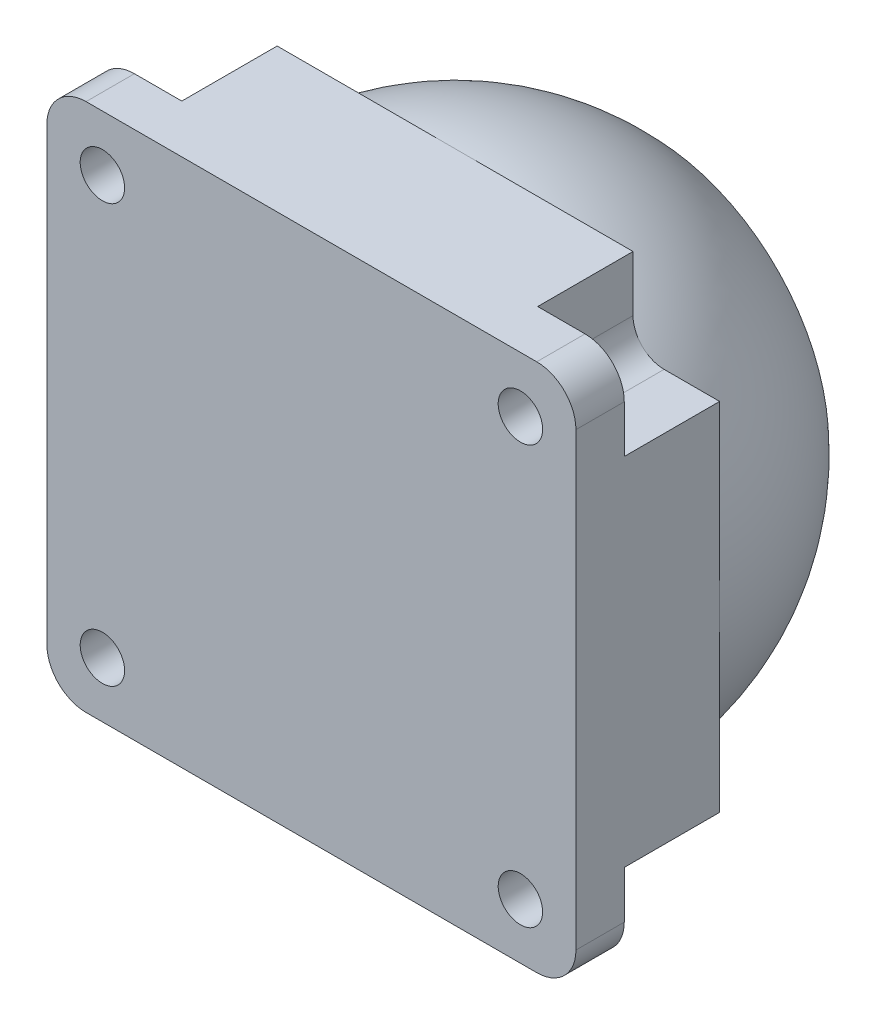
ISO-10303-21;
HEADER;
FILE_DESCRIPTION(('STEP AP214'),'2;1');
FILE_NAME('part.step','',(''),(''),'','','');
FILE_SCHEMA(('AUTOMOTIVE_DESIGN { 1 0 10303 214 1 1 1 1 }'));
ENDSEC;
DATA;
#1=APPLICATION_CONTEXT('core data for automotive mechanical design processes');
#2=APPLICATION_PROTOCOL_DEFINITION('international standard','automotive_design',2000,#1);
#3=PRODUCT_CONTEXT('',#1,'mechanical');
#4=PRODUCT('Part','Part','',(#3));
#5=PRODUCT_RELATED_PRODUCT_CATEGORY('part','',(#4));
#6=PRODUCT_DEFINITION_FORMATION('','',#4);
#7=PRODUCT_DEFINITION_CONTEXT('part definition',#1,'design');
#8=PRODUCT_DEFINITION('design','',#6,#7);
#9=PRODUCT_DEFINITION_SHAPE('','',#8);
#10=(LENGTH_UNIT() NAMED_UNIT(*) SI_UNIT(.MILLI.,.METRE.));
#11=(NAMED_UNIT(*) PLANE_ANGLE_UNIT() SI_UNIT($,.RADIAN.));
#12=(NAMED_UNIT(*) SI_UNIT($,.STERADIAN.) SOLID_ANGLE_UNIT());
#13=UNCERTAINTY_MEASURE_WITH_UNIT(LENGTH_MEASURE(1.E-05),#10,'distance_accuracy_value','');
#14=(GEOMETRIC_REPRESENTATION_CONTEXT(3) GLOBAL_UNCERTAINTY_ASSIGNED_CONTEXT((#13)) GLOBAL_UNIT_ASSIGNED_CONTEXT((#10,
#11,#12)) REPRESENTATION_CONTEXT('',''));
#15=CARTESIAN_POINT('',(0.,0.,0.));
#16=DIRECTION('',(0.,0.,1.));
#17=DIRECTION('',(1.,0.,0.));
#18=AXIS2_PLACEMENT_3D('',#15,#16,#17);
#19=CARTESIAN_POINT('',(0.,0.,0.));
#20=DIRECTION('',(0.,0.,1.));
#21=DIRECTION('',(1.,0.,0.));
#22=AXIS2_PLACEMENT_3D('',#19,#20,#21);
#23=PLANE('',#22);
#24=DIRECTION('',(0.,1.,0.));
#25=VECTOR('',#24,1.);
#26=CARTESIAN_POINT('',(20.25,20.25,0.));
#27=LINE('',#26,#25);
#28=CARTESIAN_POINT('',(20.2500000000001,-13.6225830020296,0.));
#29=VERTEX_POINT('',#28);
#30=CARTESIAN_POINT('',(20.25,0.,0.));
#31=VERTEX_POINT('',#30);
#32=EDGE_CURVE('E382',#29,#31,#27,.T.);
#33=ORIENTED_EDGE('',*,*,#32,.F.);
#34=DIRECTION('',(1.,0.,0.));
#35=VECTOR('',#34,1.);
#36=CARTESIAN_POINT('',(20.2500000000001,-13.6225830020296,0.));
#37=LINE('',#36,#35);
#38=CARTESIAN_POINT('',(16.0000000000011,-13.6225830020296,0.));
#39=VERTEX_POINT('',#38);
#40=EDGE_CURVE('E231',#39,#29,#37,.T.);
#41=ORIENTED_EDGE('',*,*,#40,.F.);
#42=CARTESIAN_POINT('',(16.0000000000011,-15.9999999999998,0.));
#43=DIRECTION('',(0.,0.,-1.));
#44=DIRECTION('',(-1.,0.,0.));
#45=AXIS2_PLACEMENT_3D('',#42,#43,#44);
#46=CIRCLE('',#45,2.37741699797018);
#47=CARTESIAN_POINT('',(14.3189123190282,-14.318912319027,0.));
#48=VERTEX_POINT('',#47);
#49=EDGE_CURVE('E487',#48,#39,#46,.T.);
#50=ORIENTED_EDGE('',*,*,#49,.F.);
#51=CARTESIAN_POINT('',(0.,0.,0.));
#52=DIRECTION('',(0.,0.,1.));
#53=DIRECTION('',(1.,0.,0.));
#54=AXIS2_PLACEMENT_3D('',#51,#52,#53);
#55=CIRCLE('',#54,20.25);
#56=EDGE_CURVE('E381',#48,#31,#55,.T.);
#57=ORIENTED_EDGE('',*,*,#56,.T.);
#58=EDGE_LOOP('',(#33,#41,#50,#57));
#59=FACE_BOUND('',#58,.T.);
#60=ADVANCED_FACE('F36',(#59),#23,.F.);
#61=CARTESIAN_POINT('',(16.0000000000009,-15.9999999999991,11.));
#62=DIRECTION('',(0.,0.,1.));
#63=DIRECTION('',(1.,0.,0.));
#64=AXIS2_PLACEMENT_3D('',#61,#62,#63);
#65=CYLINDRICAL_SURFACE('',#64,1.69999999999999);
#66=CARTESIAN_POINT('',(16.0000000000009,-15.9999999999991,11.));
#67=DIRECTION('',(0.,0.,1.));
#68=DIRECTION('',(1.,0.,0.));
#69=AXIS2_PLACEMENT_3D('',#66,#67,#68);
#70=CIRCLE('',#69,1.69999999999999);
#71=CARTESIAN_POINT('',(17.7000000000009,-15.9999999999991,11.));
#72=VERTEX_POINT('',#71);
#73=EDGE_CURVE('E361',#72,#72,#70,.T.);
#74=ORIENTED_EDGE('',*,*,#73,.T.);
#75=EDGE_LOOP('',(#74));
#76=FACE_BOUND('',#75,.T.);
#77=CARTESIAN_POINT('',(16.0000000000009,-15.9999999999991,7.3));
#78=DIRECTION('',(0.,0.,-1.));
#79=DIRECTION('',(-1.,0.,0.));
#80=AXIS2_PLACEMENT_3D('',#77,#78,#79);
#81=CIRCLE('',#80,1.69999999999999);
#82=CARTESIAN_POINT('',(14.3000000000009,-15.9999999999991,7.3));
#83=VERTEX_POINT('',#82);
#84=EDGE_CURVE('E274',#83,#83,#81,.F.);
#85=ORIENTED_EDGE('',*,*,#84,.F.);
#86=EDGE_LOOP('',(#85));
#87=FACE_BOUND('',#86,.T.);
#88=ADVANCED_FACE('F530',(#76,#87),#65,.F.);
#89=DIRECTION('',(1.,0.,0.));
#90=VECTOR('',#89,1.);
#91=CARTESIAN_POINT('',(-20.25,-20.25,0.));
#92=LINE('',#91,#90);
#93=CARTESIAN_POINT('',(-13.6225830020297,-20.2500000000001,0.));
#94=VERTEX_POINT('',#93);
#95=CARTESIAN_POINT('',(0.,-20.25,0.));
#96=VERTEX_POINT('',#95);
#97=EDGE_CURVE('E372',#94,#96,#92,.T.);
#98=ORIENTED_EDGE('',*,*,#97,.F.);
#99=DIRECTION('',(0.,-1.,0.));
#100=VECTOR('',#99,1.);
#101=CARTESIAN_POINT('',(-13.6225830020297,-20.2500000000001,0.));
#102=LINE('',#101,#100);
#103=CARTESIAN_POINT('',(-13.6225830020297,-16.000000000001,0.));
#104=VERTEX_POINT('',#103);
#105=EDGE_CURVE('E258',#104,#94,#102,.T.);
#106=ORIENTED_EDGE('',*,*,#105,.F.);
#107=CARTESIAN_POINT('',(-15.9999999999999,-16.000000000001,0.));
#108=DIRECTION('',(0.,0.,-1.));
#109=DIRECTION('',(-1.,0.,0.));
#110=AXIS2_PLACEMENT_3D('',#107,#108,#109);
#111=CIRCLE('',#110,2.37741699797018);
#112=CARTESIAN_POINT('',(-14.3189123190271,-14.3189123190281,0.));
#113=VERTEX_POINT('',#112);
#114=EDGE_CURVE('E273',#113,#104,#111,.T.);
#115=ORIENTED_EDGE('',*,*,#114,.F.);
#116=EDGE_CURVE('E396',#113,#96,#55,.T.);
#117=ORIENTED_EDGE('',*,*,#116,.T.);
#118=EDGE_LOOP('',(#98,#106,#115,#117));
#119=FACE_BOUND('',#118,.T.);
#120=ADVANCED_FACE('F532',(#119),#23,.F.);
#121=CARTESIAN_POINT('',(-15.9999999999991,-16.,11.));
#122=DIRECTION('',(0.,0.,1.));
#123=DIRECTION('',(1.,0.,0.));
#124=AXIS2_PLACEMENT_3D('',#121,#122,#123);
#125=CYLINDRICAL_SURFACE('',#124,1.69999999999999);
#126=CARTESIAN_POINT('',(-15.9999999999991,-16.,11.));
#127=DIRECTION('',(0.,0.,1.));
#128=DIRECTION('',(1.,0.,0.));
#129=AXIS2_PLACEMENT_3D('',#126,#127,#128);
#130=CIRCLE('',#129,1.69999999999999);
#131=CARTESIAN_POINT('',(-14.2999999999991,-16.,11.));
#132=VERTEX_POINT('',#131);
#133=EDGE_CURVE('E364',#132,#132,#130,.T.);
#134=ORIENTED_EDGE('',*,*,#133,.T.);
#135=EDGE_LOOP('',(#134));
#136=FACE_BOUND('',#135,.T.);
#137=CARTESIAN_POINT('',(-15.9999999999991,-16.,7.3));
#138=DIRECTION('',(0.,0.,-1.));
#139=DIRECTION('',(-1.,0.,0.));
#140=AXIS2_PLACEMENT_3D('',#137,#138,#139);
#141=CIRCLE('',#140,1.69999999999999);
#142=CARTESIAN_POINT('',(-17.6999999999991,-16.,7.3));
#143=VERTEX_POINT('',#142);
#144=EDGE_CURVE('E281',#143,#143,#141,.F.);
#145=ORIENTED_EDGE('',*,*,#144,.F.);
#146=EDGE_LOOP('',(#145));
#147=FACE_BOUND('',#146,.T.);
#148=ADVANCED_FACE('F542',(#136,#147),#125,.F.);
#149=DIRECTION('',(0.,-1.,0.));
#150=VECTOR('',#149,1.);
#151=CARTESIAN_POINT('',(-20.25,20.25,0.));
#152=LINE('',#151,#150);
#153=CARTESIAN_POINT('',(-20.2500000000001,13.6225830020297,0.));
#154=VERTEX_POINT('',#153);
#155=CARTESIAN_POINT('',(-20.25,0.,0.));
#156=VERTEX_POINT('',#155);
#157=EDGE_CURVE('E389',#154,#156,#152,.T.);
#158=ORIENTED_EDGE('',*,*,#157,.F.);
#159=DIRECTION('',(-1.,0.,0.));
#160=VECTOR('',#159,1.);
#161=CARTESIAN_POINT('',(-20.2500000000001,13.6225830020297,0.));
#162=LINE('',#161,#160);
#163=CARTESIAN_POINT('',(-16.000000000001,13.6225830020298,0.));
#164=VERTEX_POINT('',#163);
#165=EDGE_CURVE('E291',#164,#154,#162,.T.);
#166=ORIENTED_EDGE('',*,*,#165,.F.);
#167=CARTESIAN_POINT('',(-16.000000000001,15.9999999999999,0.));
#168=DIRECTION('',(0.,0.,-1.));
#169=DIRECTION('',(-1.,0.,0.));
#170=AXIS2_PLACEMENT_3D('',#167,#168,#169);
#171=CIRCLE('',#170,2.37741699797018);
#172=CARTESIAN_POINT('',(-14.3189123190281,14.3189123190271,0.));
#173=VERTEX_POINT('',#172);
#174=EDGE_CURVE('E305',#173,#164,#171,.T.);
#175=ORIENTED_EDGE('',*,*,#174,.F.);
#176=EDGE_CURVE('E471',#173,#156,#55,.T.);
#177=ORIENTED_EDGE('',*,*,#176,.T.);
#178=EDGE_LOOP('',(#158,#166,#175,#177));
#179=FACE_BOUND('',#178,.T.);
#180=ADVANCED_FACE('F468',(#179),#23,.F.);
#181=CARTESIAN_POINT('',(-16.,16.,11.));
#182=DIRECTION('',(0.,0.,1.));
#183=DIRECTION('',(1.,0.,0.));
#184=AXIS2_PLACEMENT_3D('',#181,#182,#183);
#185=CYLINDRICAL_SURFACE('',#184,1.69999999999999);
#186=CARTESIAN_POINT('',(-16.,16.,11.));
#187=DIRECTION('',(0.,0.,1.));
#188=DIRECTION('',(1.,0.,0.));
#189=AXIS2_PLACEMENT_3D('',#186,#187,#188);
#190=CIRCLE('',#189,1.69999999999999);
#191=CARTESIAN_POINT('',(-14.3,16.,11.));
#192=VERTEX_POINT('',#191);
#193=EDGE_CURVE('E354',#192,#192,#190,.T.);
#194=ORIENTED_EDGE('',*,*,#193,.T.);
#195=EDGE_LOOP('',(#194));
#196=FACE_BOUND('',#195,.T.);
#197=CARTESIAN_POINT('',(-16.,16.,7.3));
#198=DIRECTION('',(0.,0.,-1.));
#199=DIRECTION('',(-1.,0.,0.));
#200=AXIS2_PLACEMENT_3D('',#197,#198,#199);
#201=CIRCLE('',#200,1.69999999999999);
#202=CARTESIAN_POINT('',(-17.7,16.,7.3));
#203=VERTEX_POINT('',#202);
#204=EDGE_CURVE('E312',#203,#203,#201,.F.);
#205=ORIENTED_EDGE('',*,*,#204,.F.);
#206=EDGE_LOOP('',(#205));
#207=FACE_BOUND('',#206,.T.);
#208=ADVANCED_FACE('F618',(#196,#207),#185,.F.);
#209=DIRECTION('',(-1.,0.,0.));
#210=VECTOR('',#209,1.);
#211=CARTESIAN_POINT('',(-20.25,20.25,0.));
#212=LINE('',#211,#210);
#213=CARTESIAN_POINT('',(13.6225830020298,20.25,0.));
#214=VERTEX_POINT('',#213);
#215=CARTESIAN_POINT('',(0.,20.25,0.));
#216=VERTEX_POINT('',#215);
#217=EDGE_CURVE('E385',#214,#216,#212,.T.);
#218=ORIENTED_EDGE('',*,*,#217,.F.);
#219=DIRECTION('',(0.,1.,0.));
#220=VECTOR('',#219,1.);
#221=CARTESIAN_POINT('',(13.6225830020298,20.25,0.));
#222=LINE('',#221,#220);
#223=CARTESIAN_POINT('',(13.6225830020298,16.0000000000009,0.));
#224=VERTEX_POINT('',#223);
#225=EDGE_CURVE('E322',#224,#214,#222,.T.);
#226=ORIENTED_EDGE('',*,*,#225,.F.);
#227=CARTESIAN_POINT('',(16.,16.0000000000009,0.));
#228=DIRECTION('',(0.,0.,-1.));
#229=DIRECTION('',(-1.,0.,0.));
#230=AXIS2_PLACEMENT_3D('',#227,#228,#229);
#231=CIRCLE('',#230,2.37741699797018);
#232=CARTESIAN_POINT('',(14.3189123190272,14.318912319028,0.));
#233=VERTEX_POINT('',#232);
#234=EDGE_CURVE('E337',#233,#224,#231,.T.);
#235=ORIENTED_EDGE('',*,*,#234,.F.);
#236=CARTESIAN_POINT('',(0.,0.,0.));
#237=DIRECTION('',(0.,0.,1.));
#238=DIRECTION('',(1.,0.,0.));
#239=AXIS2_PLACEMENT_3D('',#236,#237,#238);
#240=CIRCLE('',#239,20.25);
#241=EDGE_CURVE('E355',#233,#216,#240,.T.);
#242=ORIENTED_EDGE('',*,*,#241,.T.);
#243=EDGE_LOOP('',(#218,#226,#235,#242));
#244=FACE_BOUND('',#243,.T.);
#245=ADVANCED_FACE('F598',(#244),#23,.F.);
#246=CARTESIAN_POINT('',(16.,16.0000000000009,11.));
#247=DIRECTION('',(0.,0.,1.));
#248=DIRECTION('',(1.,0.,0.));
#249=AXIS2_PLACEMENT_3D('',#246,#247,#248);
#250=CYLINDRICAL_SURFACE('',#249,1.69999999999999);
#251=CARTESIAN_POINT('',(16.,16.0000000000009,11.));
#252=DIRECTION('',(0.,0.,1.));
#253=DIRECTION('',(1.,0.,0.));
#254=AXIS2_PLACEMENT_3D('',#251,#252,#253);
#255=CIRCLE('',#254,1.69999999999999);
#256=CARTESIAN_POINT('',(17.7,16.0000000000009,11.));
#257=VERTEX_POINT('',#256);
#258=EDGE_CURVE('E358',#257,#257,#255,.T.);
#259=ORIENTED_EDGE('',*,*,#258,.T.);
#260=EDGE_LOOP('',(#259));
#261=FACE_BOUND('',#260,.T.);
#262=CARTESIAN_POINT('',(16.,16.0000000000009,7.3));
#263=DIRECTION('',(0.,0.,-1.));
#264=DIRECTION('',(-1.,0.,0.));
#265=AXIS2_PLACEMENT_3D('',#262,#263,#264);
#266=CIRCLE('',#265,1.69999999999999);
#267=CARTESIAN_POINT('',(14.3,16.0000000000009,7.3));
#268=VERTEX_POINT('',#267);
#269=EDGE_CURVE('E344',#268,#268,#266,.F.);
#270=ORIENTED_EDGE('',*,*,#269,.F.);
#271=EDGE_LOOP('',(#270));
#272=FACE_BOUND('',#271,.T.);
#273=ADVANCED_FACE('F617',(#261,#272),#250,.F.);
#274=CARTESIAN_POINT('',(0.,0.,0.));
#275=DIRECTION('',(0.,0.,1.));
#276=DIRECTION('',(-1.,0.,0.));
#277=AXIS2_PLACEMENT_3D('',#274,#275,#276);
#278=SPHERICAL_SURFACE('',#277,20.25);
#279=EDGE_CURVE('E351',#31,#233,#240,.T.);
#280=ORIENTED_EDGE('',*,*,#279,.F.);
#281=ORIENTED_EDGE('',*,*,#56,.F.);
#282=EDGE_CURVE('E393',#96,#48,#55,.T.);
#283=ORIENTED_EDGE('',*,*,#282,.F.);
#284=ORIENTED_EDGE('',*,*,#116,.F.);
#285=EDGE_CURVE('E397',#156,#113,#55,.T.);
#286=ORIENTED_EDGE('',*,*,#285,.F.);
#287=ORIENTED_EDGE('',*,*,#176,.F.);
#288=EDGE_CURVE('E413',#216,#173,#55,.T.);
#289=ORIENTED_EDGE('',*,*,#288,.F.);
#290=ORIENTED_EDGE('',*,*,#241,.F.);
#291=EDGE_LOOP('',(#280,#281,#283,#284,#286,#287,#289,#290));
#292=FACE_BOUND('',#291,.T.);
#293=CARTESIAN_POINT('',(0.,0.,-15.));
#294=DIRECTION('',(0.,0.,-1.));
#295=DIRECTION('',(-1.,0.,0.));
#296=AXIS2_PLACEMENT_3D('',#293,#294,#295);
#297=CIRCLE('',#296,13.6037678604128);
#298=CARTESIAN_POINT('',(-13.6037678604128,0.,-15.));
#299=VERTEX_POINT('',#298);
#300=EDGE_CURVE('E398',#299,#299,#297,.F.);
#301=ORIENTED_EDGE('',*,*,#300,.T.);
#302=EDGE_LOOP('',(#301));
#303=FACE_BOUND('',#302,.T.);
#304=ADVANCED_FACE('F491',(#292,#303),#278,.T.);
#305=ORIENTED_EDGE('',*,*,#279,.T.);
#306=CARTESIAN_POINT('',(16.,13.6225830020308,0.));
#307=VERTEX_POINT('',#306);
#308=EDGE_CURVE('E338',#307,#233,#231,.T.);
#309=ORIENTED_EDGE('',*,*,#308,.F.);
#310=DIRECTION('',(-1.,0.,0.));
#311=VECTOR('',#310,1.);
#312=CARTESIAN_POINT('',(20.25,13.6225830020308,0.));
#313=LINE('',#312,#311);
#314=CARTESIAN_POINT('',(20.25,13.6225830020308,0.));
#315=VERTEX_POINT('',#314);
#316=EDGE_CURVE('E334',#315,#307,#313,.T.);
#317=ORIENTED_EDGE('',*,*,#316,.F.);
#318=EDGE_CURVE('E367',#31,#315,#27,.T.);
#319=ORIENTED_EDGE('',*,*,#318,.F.);
#320=EDGE_LOOP('',(#305,#309,#317,#319));
#321=FACE_BOUND('',#320,.T.);
#322=ADVANCED_FACE('F497',(#321),#23,.F.);
#323=ORIENTED_EDGE('',*,*,#288,.T.);
#324=CARTESIAN_POINT('',(-13.6225830020308,15.9999999999999,0.));
#325=VERTEX_POINT('',#324);
#326=EDGE_CURVE('E306',#325,#173,#171,.T.);
#327=ORIENTED_EDGE('',*,*,#326,.F.);
#328=DIRECTION('',(0.,-1.,0.));
#329=VECTOR('',#328,1.);
#330=CARTESIAN_POINT('',(-13.6225830020308,20.2499999999999,0.));
#331=LINE('',#330,#329);
#332=CARTESIAN_POINT('',(-13.6225830020308,20.2499999999999,0.));
#333=VERTEX_POINT('',#332);
#334=EDGE_CURVE('E302',#333,#325,#331,.T.);
#335=ORIENTED_EDGE('',*,*,#334,.F.);
#336=EDGE_CURVE('E384',#216,#333,#212,.T.);
#337=ORIENTED_EDGE('',*,*,#336,.F.);
#338=EDGE_LOOP('',(#323,#327,#335,#337));
#339=FACE_BOUND('',#338,.T.);
#340=ADVANCED_FACE('F556',(#339),#23,.F.);
#341=ORIENTED_EDGE('',*,*,#285,.T.);
#342=CARTESIAN_POINT('',(-15.9999999999999,-13.6225830020309,0.));
#343=VERTEX_POINT('',#342);
#344=EDGE_CURVE('E275',#343,#113,#111,.T.);
#345=ORIENTED_EDGE('',*,*,#344,.F.);
#346=DIRECTION('',(1.,0.,0.));
#347=VECTOR('',#346,1.);
#348=CARTESIAN_POINT('',(-20.2499999999999,-13.6225830020309,0.));
#349=LINE('',#348,#347);
#350=CARTESIAN_POINT('',(-20.2499999999999,-13.6225830020309,0.));
#351=VERTEX_POINT('',#350);
#352=EDGE_CURVE('E270',#351,#343,#349,.T.);
#353=ORIENTED_EDGE('',*,*,#352,.F.);
#354=EDGE_CURVE('E388',#156,#351,#152,.T.);
#355=ORIENTED_EDGE('',*,*,#354,.F.);
#356=EDGE_LOOP('',(#341,#345,#353,#355));
#357=FACE_BOUND('',#356,.T.);
#358=ADVANCED_FACE('F546',(#357),#23,.F.);
#359=CARTESIAN_POINT('',(20.25,20.25,11.));
#360=DIRECTION('',(-1.,0.,0.));
#361=DIRECTION('',(0.,-1.,0.));
#362=AXIS2_PLACEMENT_3D('',#359,#360,#361);
#363=PLANE('',#362);
#364=DIRECTION('',(0.,1.,0.));
#365=VECTOR('',#364,1.);
#366=CARTESIAN_POINT('',(20.25,20.25,11.));
#367=LINE('',#366,#365);
#368=CARTESIAN_POINT('',(20.25,-17.25,11.));
#369=VERTEX_POINT('',#368);
#370=CARTESIAN_POINT('',(20.25,17.25,11.));
#371=VERTEX_POINT('',#370);
#372=EDGE_CURVE('E368',#369,#371,#367,.T.);
#373=ORIENTED_EDGE('',*,*,#372,.F.);
#374=DIRECTION('',(0.,0.,-1.));
#375=VECTOR('',#374,1.);
#376=CARTESIAN_POINT('',(20.25,-17.25,11.));
#377=LINE('',#376,#375);
#378=CARTESIAN_POINT('',(20.2500000000002,-17.25,7.3));
#379=VERTEX_POINT('',#378);
#380=EDGE_CURVE('E412',#369,#379,#377,.T.);
#381=ORIENTED_EDGE('',*,*,#380,.T.);
#382=DIRECTION('',(0.,-1.,0.));
#383=VECTOR('',#382,1.);
#384=CARTESIAN_POINT('',(20.2500000000002,-20.2499999999998,7.3));
#385=LINE('',#384,#383);
#386=CARTESIAN_POINT('',(20.2500000000001,-13.6225830020296,7.3));
#387=VERTEX_POINT('',#386);
#388=EDGE_CURVE('E247',#387,#379,#385,.T.);
#389=ORIENTED_EDGE('',*,*,#388,.F.);
#390=DIRECTION('',(0.,0.,-1.));
#391=VECTOR('',#390,1.);
#392=CARTESIAN_POINT('',(20.2500000000001,-13.6225830020296,7.3));
#393=LINE('',#392,#391);
#394=EDGE_CURVE('E409',#387,#29,#393,.T.);
#395=ORIENTED_EDGE('',*,*,#394,.T.);
#396=ORIENTED_EDGE('',*,*,#32,.T.);
#397=ORIENTED_EDGE('',*,*,#318,.T.);
#398=DIRECTION('',(0.,0.,-1.));
#399=VECTOR('',#398,1.);
#400=CARTESIAN_POINT('',(20.25,13.6225830020308,7.3));
#401=LINE('',#400,#399);
#402=CARTESIAN_POINT('',(20.25,13.6225830020308,7.3));
#403=VERTEX_POINT('',#402);
#404=EDGE_CURVE('E333',#403,#315,#401,.T.);
#405=ORIENTED_EDGE('',*,*,#404,.F.);
#406=DIRECTION('',(0.,-1.,0.));
#407=VECTOR('',#406,1.);
#408=CARTESIAN_POINT('',(20.25,20.25,7.3));
#409=LINE('',#408,#407);
#410=CARTESIAN_POINT('',(20.25,17.25,7.3));
#411=VERTEX_POINT('',#410);
#412=EDGE_CURVE('E319',#411,#403,#409,.T.);
#413=ORIENTED_EDGE('',*,*,#412,.F.);
#414=DIRECTION('',(0.,0.,-1.));
#415=VECTOR('',#414,1.);
#416=CARTESIAN_POINT('',(20.25,17.25,11.));
#417=LINE('',#416,#415);
#418=EDGE_CURVE('E410',#411,#371,#417,.F.);
#419=ORIENTED_EDGE('',*,*,#418,.T.);
#420=EDGE_LOOP('',(#373,#381,#389,#395,#396,#397,#405,#413,#419));
#421=FACE_BOUND('',#420,.T.);
#422=ADVANCED_FACE('F501',(#421),#363,.F.);
#423=CARTESIAN_POINT('',(-20.25,20.25,11.));
#424=DIRECTION('',(0.,-1.,0.));
#425=DIRECTION('',(0.,0.,-1.));
#426=AXIS2_PLACEMENT_3D('',#423,#424,#425);
#427=PLANE('',#426);
#428=DIRECTION('',(1.,0.,0.));
#429=VECTOR('',#428,1.);
#430=CARTESIAN_POINT('',(-20.2500000000001,20.2499999999999,7.3));
#431=LINE('',#430,#429);
#432=CARTESIAN_POINT('',(-17.25,20.2499999999999,7.3));
#433=VERTEX_POINT('',#432);
#434=CARTESIAN_POINT('',(-13.6225830020308,20.2499999999999,7.3));
#435=VERTEX_POINT('',#434);
#436=EDGE_CURVE('E288',#433,#435,#431,.T.);
#437=ORIENTED_EDGE('',*,*,#436,.F.);
#438=DIRECTION('',(0.,0.,-1.));
#439=VECTOR('',#438,1.);
#440=CARTESIAN_POINT('',(-17.25,20.25,11.));
#441=LINE('',#440,#439);
#442=CARTESIAN_POINT('',(-17.25,20.25,11.));
#443=VERTEX_POINT('',#442);
#444=EDGE_CURVE('E44',#433,#443,#441,.F.);
#445=ORIENTED_EDGE('',*,*,#444,.T.);
#446=DIRECTION('',(-1.,0.,0.));
#447=VECTOR('',#446,1.);
#448=CARTESIAN_POINT('',(-20.25,20.25,11.));
#449=LINE('',#448,#447);
#450=CARTESIAN_POINT('',(17.25,20.25,11.));
#451=VERTEX_POINT('',#450);
#452=EDGE_CURVE('E371',#451,#443,#449,.T.);
#453=ORIENTED_EDGE('',*,*,#452,.F.);
#454=DIRECTION('',(0.,0.,-1.));
#455=VECTOR('',#454,1.);
#456=CARTESIAN_POINT('',(17.25,20.25,11.));
#457=LINE('',#456,#455);
#458=CARTESIAN_POINT('',(17.25,20.25,7.3));
#459=VERTEX_POINT('',#458);
#460=EDGE_CURVE('E438',#451,#459,#457,.T.);
#461=ORIENTED_EDGE('',*,*,#460,.T.);
#462=DIRECTION('',(1.,0.,0.));
#463=VECTOR('',#462,1.);
#464=CARTESIAN_POINT('',(20.25,20.25,7.3));
#465=LINE('',#464,#463);
#466=CARTESIAN_POINT('',(13.6225830020298,20.25,7.3));
#467=VERTEX_POINT('',#466);
#468=EDGE_CURVE('E330',#467,#459,#465,.T.);
#469=ORIENTED_EDGE('',*,*,#468,.F.);
#470=DIRECTION('',(0.,0.,-1.));
#471=VECTOR('',#470,1.);
#472=CARTESIAN_POINT('',(13.6225830020298,20.25,7.3));
#473=LINE('',#472,#471);
#474=EDGE_CURVE('E341',#467,#214,#473,.T.);
#475=ORIENTED_EDGE('',*,*,#474,.T.);
#476=ORIENTED_EDGE('',*,*,#217,.T.);
#477=ORIENTED_EDGE('',*,*,#336,.T.);
#478=DIRECTION('',(0.,0.,-1.));
#479=VECTOR('',#478,1.);
#480=CARTESIAN_POINT('',(-13.6225830020308,20.2499999999999,7.3));
#481=LINE('',#480,#479);
#482=EDGE_CURVE('E301',#435,#333,#481,.T.);
#483=ORIENTED_EDGE('',*,*,#482,.F.);
#484=EDGE_LOOP('',(#437,#445,#453,#461,#469,#475,#476,#477,#483));
#485=FACE_BOUND('',#484,.T.);
#486=ADVANCED_FACE('F442',(#485),#427,.F.);
#487=CARTESIAN_POINT('',(-20.25,20.25,11.));
#488=DIRECTION('',(1.,0.,0.));
#489=DIRECTION('',(0.,1.,0.));
#490=AXIS2_PLACEMENT_3D('',#487,#488,#489);
#491=PLANE('',#490);
#492=DIRECTION('',(0.,1.,0.));
#493=VECTOR('',#492,1.);
#494=CARTESIAN_POINT('',(-20.2499999999999,-20.2500000000001,7.3));
#495=LINE('',#494,#493);
#496=CARTESIAN_POINT('',(-20.2499999999999,-17.25,7.3));
#497=VERTEX_POINT('',#496);
#498=CARTESIAN_POINT('',(-20.2499999999999,-13.6225830020309,7.3));
#499=VERTEX_POINT('',#498);
#500=EDGE_CURVE('E255',#497,#499,#495,.T.);
#501=ORIENTED_EDGE('',*,*,#500,.F.);
#502=DIRECTION('',(0.,0.,-1.));
#503=VECTOR('',#502,1.);
#504=CARTESIAN_POINT('',(-20.25,-17.25,11.));
#505=LINE('',#504,#503);
#506=CARTESIAN_POINT('',(-20.25,-17.25,11.));
#507=VERTEX_POINT('',#506);
#508=EDGE_CURVE('E435',#497,#507,#505,.F.);
#509=ORIENTED_EDGE('',*,*,#508,.T.);
#510=DIRECTION('',(0.,-1.,0.));
#511=VECTOR('',#510,1.);
#512=CARTESIAN_POINT('',(-20.25,20.25,11.));
#513=LINE('',#512,#511);
#514=CARTESIAN_POINT('',(-20.25,17.25,11.));
#515=VERTEX_POINT('',#514);
#516=EDGE_CURVE('E375',#515,#507,#513,.T.);
#517=ORIENTED_EDGE('',*,*,#516,.F.);
#518=DIRECTION('',(0.,0.,-1.));
#519=VECTOR('',#518,1.);
#520=CARTESIAN_POINT('',(-20.25,17.25,11.));
#521=LINE('',#520,#519);
#522=CARTESIAN_POINT('',(-20.2500000000001,17.25,7.3));
#523=VERTEX_POINT('',#522);
#524=EDGE_CURVE('E432',#515,#523,#521,.T.);
#525=ORIENTED_EDGE('',*,*,#524,.T.);
#526=DIRECTION('',(0.,1.,0.));
#527=VECTOR('',#526,1.);
#528=CARTESIAN_POINT('',(-20.2500000000001,20.2499999999999,7.3));
#529=LINE('',#528,#527);
#530=CARTESIAN_POINT('',(-20.25,13.6225830020297,7.3));
#531=VERTEX_POINT('',#530);
#532=EDGE_CURVE('E299',#531,#523,#529,.T.);
#533=ORIENTED_EDGE('',*,*,#532,.F.);
#534=DIRECTION('',(0.,0.,-1.));
#535=VECTOR('',#534,1.);
#536=CARTESIAN_POINT('',(-20.2500000000001,13.6225830020297,7.3));
#537=LINE('',#536,#535);
#538=EDGE_CURVE('E309',#531,#154,#537,.T.);
#539=ORIENTED_EDGE('',*,*,#538,.T.);
#540=ORIENTED_EDGE('',*,*,#157,.T.);
#541=ORIENTED_EDGE('',*,*,#354,.T.);
#542=DIRECTION('',(0.,0.,-1.));
#543=VECTOR('',#542,1.);
#544=CARTESIAN_POINT('',(-20.2499999999999,-13.6225830020309,7.3));
#545=LINE('',#544,#543);
#546=EDGE_CURVE('E269',#499,#351,#545,.T.);
#547=ORIENTED_EDGE('',*,*,#546,.F.);
#548=EDGE_LOOP('',(#501,#509,#517,#525,#533,#539,#540,#541,#547));
#549=FACE_BOUND('',#548,.T.);
#550=ADVANCED_FACE('F455',(#549),#491,.F.);
#551=CARTESIAN_POINT('',(-20.25,-20.25,11.));
#552=DIRECTION('',(0.,1.,0.));
#553=DIRECTION('',(0.,0.,1.));
#554=AXIS2_PLACEMENT_3D('',#551,#552,#553);
#555=PLANE('',#554);
#556=DIRECTION('',(-1.,0.,0.));
#557=VECTOR('',#556,1.);
#558=CARTESIAN_POINT('',(20.2500000000002,-20.2499999999998,7.3));
#559=LINE('',#558,#557);
#560=CARTESIAN_POINT('',(17.25,-20.2499999999998,7.3));
#561=VERTEX_POINT('',#560);
#562=CARTESIAN_POINT('',(13.622583002031,-20.2499999999998,7.3));
#563=VERTEX_POINT('',#562);
#564=EDGE_CURVE('E220',#561,#563,#559,.T.);
#565=ORIENTED_EDGE('',*,*,#564,.F.);
#566=DIRECTION('',(0.,0.,-1.));
#567=VECTOR('',#566,1.);
#568=CARTESIAN_POINT('',(17.25,-20.25,11.));
#569=LINE('',#568,#567);
#570=CARTESIAN_POINT('',(17.25,-20.25,11.));
#571=VERTEX_POINT('',#570);
#572=EDGE_CURVE('E420',#561,#571,#569,.F.);
#573=ORIENTED_EDGE('',*,*,#572,.T.);
#574=DIRECTION('',(1.,0.,0.));
#575=VECTOR('',#574,1.);
#576=CARTESIAN_POINT('',(-20.25,-20.25,11.));
#577=LINE('',#576,#575);
#578=CARTESIAN_POINT('',(-17.25,-20.25,11.));
#579=VERTEX_POINT('',#578);
#580=EDGE_CURVE('E378',#579,#571,#577,.T.);
#581=ORIENTED_EDGE('',*,*,#580,.F.);
#582=DIRECTION('',(0.,0.,-1.));
#583=VECTOR('',#582,1.);
#584=CARTESIAN_POINT('',(-17.25,-20.25,11.));
#585=LINE('',#584,#583);
#586=CARTESIAN_POINT('',(-17.25,-20.2500000000001,7.3));
#587=VERTEX_POINT('',#586);
#588=EDGE_CURVE('E417',#579,#587,#585,.T.);
#589=ORIENTED_EDGE('',*,*,#588,.T.);
#590=DIRECTION('',(-1.,0.,0.));
#591=VECTOR('',#590,1.);
#592=CARTESIAN_POINT('',(-20.2499999999999,-20.2500000000001,7.3));
#593=LINE('',#592,#591);
#594=CARTESIAN_POINT('',(-13.6225830020297,-20.25,7.3));
#595=VERTEX_POINT('',#594);
#596=EDGE_CURVE('E266',#595,#587,#593,.T.);
#597=ORIENTED_EDGE('',*,*,#596,.F.);
#598=DIRECTION('',(0.,0.,-1.));
#599=VECTOR('',#598,1.);
#600=CARTESIAN_POINT('',(-13.6225830020297,-20.2500000000001,7.3));
#601=LINE('',#600,#599);
#602=EDGE_CURVE('E278',#595,#94,#601,.T.);
#603=ORIENTED_EDGE('',*,*,#602,.T.);
#604=ORIENTED_EDGE('',*,*,#97,.T.);
#605=CARTESIAN_POINT('',(13.6225830020309,-20.25,0.));
#606=VERTEX_POINT('',#605);
#607=EDGE_CURVE('E246',#96,#606,#92,.T.);
#608=ORIENTED_EDGE('',*,*,#607,.T.);
#609=DIRECTION('',(0.,0.,-1.));
#610=VECTOR('',#609,1.);
#611=CARTESIAN_POINT('',(13.622583002031,-20.2499999999998,7.3));
#612=LINE('',#611,#610);
#613=EDGE_CURVE('E236',#563,#606,#612,.T.);
#614=ORIENTED_EDGE('',*,*,#613,.F.);
#615=EDGE_LOOP('',(#565,#573,#581,#589,#597,#603,#604,#608,#614));
#616=FACE_BOUND('',#615,.T.);
#617=ADVANCED_FACE('F243',(#616),#555,.F.);
#618=CARTESIAN_POINT('',(0.,0.,11.));
#619=DIRECTION('',(0.,0.,1.));
#620=DIRECTION('',(1.,0.,0.));
#621=AXIS2_PLACEMENT_3D('',#618,#619,#620);
#622=PLANE('',#621);
#623=ORIENTED_EDGE('',*,*,#193,.F.);
#624=EDGE_LOOP('',(#623));
#625=FACE_BOUND('',#624,.T.);
#626=ORIENTED_EDGE('',*,*,#258,.F.);
#627=EDGE_LOOP('',(#626));
#628=FACE_BOUND('',#627,.T.);
#629=ORIENTED_EDGE('',*,*,#73,.F.);
#630=EDGE_LOOP('',(#629));
#631=FACE_BOUND('',#630,.T.);
#632=ORIENTED_EDGE('',*,*,#133,.F.);
#633=EDGE_LOOP('',(#632));
#634=FACE_BOUND('',#633,.T.);
#635=ORIENTED_EDGE('',*,*,#580,.T.);
#636=CARTESIAN_POINT('',(17.25,-17.25,11.));
#637=DIRECTION('',(0.,0.,1.));
#638=DIRECTION('',(1.,0.,0.));
#639=AXIS2_PLACEMENT_3D('',#636,#637,#638);
#640=CIRCLE('',#639,3.);
#641=EDGE_CURVE('E428',#571,#369,#640,.T.);
#642=ORIENTED_EDGE('',*,*,#641,.T.);
#643=ORIENTED_EDGE('',*,*,#372,.T.);
#644=CARTESIAN_POINT('',(17.25,17.25,11.));
#645=DIRECTION('',(0.,0.,1.));
#646=DIRECTION('',(1.,0.,0.));
#647=AXIS2_PLACEMENT_3D('',#644,#645,#646);
#648=CIRCLE('',#647,3.);
#649=EDGE_CURVE('E422',#371,#451,#648,.T.);
#650=ORIENTED_EDGE('',*,*,#649,.T.);
#651=ORIENTED_EDGE('',*,*,#452,.T.);
#652=CARTESIAN_POINT('',(-17.25,17.25,11.));
#653=DIRECTION('',(0.,0.,1.));
#654=DIRECTION('',(1.,0.,0.));
#655=AXIS2_PLACEMENT_3D('',#652,#653,#654);
#656=CIRCLE('',#655,3.);
#657=EDGE_CURVE('E424',#443,#515,#656,.T.);
#658=ORIENTED_EDGE('',*,*,#657,.T.);
#659=ORIENTED_EDGE('',*,*,#516,.T.);
#660=CARTESIAN_POINT('',(-17.25,-17.25,11.));
#661=DIRECTION('',(0.,0.,1.));
#662=DIRECTION('',(1.,0.,0.));
#663=AXIS2_PLACEMENT_3D('',#660,#661,#662);
#664=CIRCLE('',#663,3.);
#665=EDGE_CURVE('E426',#507,#579,#664,.T.);
#666=ORIENTED_EDGE('',*,*,#665,.T.);
#667=EDGE_LOOP('',(#635,#642,#643,#650,#651,#658,#659,#666));
#668=FACE_BOUND('',#667,.T.);
#669=ADVANCED_FACE('F447',(#625,#628,#631,#634,#668),#622,.T.);
#670=ORIENTED_EDGE('',*,*,#282,.T.);
#671=CARTESIAN_POINT('',(13.6225830020309,-15.9999999999999,0.));
#672=VERTEX_POINT('',#671);
#673=EDGE_CURVE('E512',#672,#48,#46,.T.);
#674=ORIENTED_EDGE('',*,*,#673,.F.);
#675=DIRECTION('',(0.,1.,0.));
#676=VECTOR('',#675,1.);
#677=CARTESIAN_POINT('',(13.622583002031,-20.2499999999998,0.));
#678=LINE('',#677,#676);
#679=EDGE_CURVE('E514',#606,#672,#678,.T.);
#680=ORIENTED_EDGE('',*,*,#679,.F.);
#681=ORIENTED_EDGE('',*,*,#607,.F.);
#682=EDGE_LOOP('',(#670,#674,#680,#681));
#683=FACE_BOUND('',#682,.T.);
#684=ADVANCED_FACE('F533',(#683),#23,.F.);
#685=CARTESIAN_POINT('',(0.,0.,-15.));
#686=DIRECTION('',(0.,0.,-1.));
#687=DIRECTION('',(-1.,0.,0.));
#688=AXIS2_PLACEMENT_3D('',#685,#686,#687);
#689=PLANE('',#688);
#690=ORIENTED_EDGE('',*,*,#300,.F.);
#691=EDGE_LOOP('',(#690));
#692=FACE_BOUND('',#691,.T.);
#693=ADVANCED_FACE('F544',(#692),#689,.T.);
#694=CARTESIAN_POINT('',(16.,16.0000000000009,7.3));
#695=DIRECTION('',(0.,0.,-1.));
#696=DIRECTION('',(-1.,0.,0.));
#697=AXIS2_PLACEMENT_3D('',#694,#695,#696);
#698=PLANE('',#697);
#699=ORIENTED_EDGE('',*,*,#468,.T.);
#700=CARTESIAN_POINT('',(17.25,17.25,7.3));
#701=DIRECTION('',(0.,0.,-1.));
#702=DIRECTION('',(-1.,0.,0.));
#703=AXIS2_PLACEMENT_3D('',#700,#701,#702);
#704=CIRCLE('',#703,3.);
#705=EDGE_CURVE('E11',#459,#411,#704,.T.);
#706=ORIENTED_EDGE('',*,*,#705,.T.);
#707=ORIENTED_EDGE('',*,*,#412,.T.);
#708=DIRECTION('',(-1.,0.,0.));
#709=VECTOR('',#708,1.);
#710=CARTESIAN_POINT('',(20.25,13.6225830020308,7.3));
#711=LINE('',#710,#709);
#712=CARTESIAN_POINT('',(16.,13.6225830020308,7.3));
#713=VERTEX_POINT('',#712);
#714=EDGE_CURVE('E321',#403,#713,#711,.T.);
#715=ORIENTED_EDGE('',*,*,#714,.T.);
#716=CARTESIAN_POINT('',(16.,16.0000000000009,7.3));
#717=DIRECTION('',(0.,0.,-1.));
#718=DIRECTION('',(-1.,0.,0.));
#719=AXIS2_PLACEMENT_3D('',#716,#717,#718);
#720=CIRCLE('',#719,2.37741699797018);
#721=CARTESIAN_POINT('',(13.6225830020298,16.0000000000009,7.3));
#722=VERTEX_POINT('',#721);
#723=EDGE_CURVE('E325',#713,#722,#720,.T.);
#724=ORIENTED_EDGE('',*,*,#723,.T.);
#725=DIRECTION('',(0.,1.,0.));
#726=VECTOR('',#725,1.);
#727=CARTESIAN_POINT('',(13.6225830020298,20.25,7.3));
#728=LINE('',#727,#726);
#729=EDGE_CURVE('E328',#722,#467,#728,.T.);
#730=ORIENTED_EDGE('',*,*,#729,.T.);
#731=EDGE_LOOP('',(#699,#706,#707,#715,#724,#730));
#732=FACE_BOUND('',#731,.T.);
#733=ORIENTED_EDGE('',*,*,#269,.T.);
#734=EDGE_LOOP('',(#733));
#735=FACE_BOUND('',#734,.T.);
#736=ADVANCED_FACE('F551',(#732,#735),#698,.T.);
#737=CARTESIAN_POINT('',(13.6225830020298,20.25,7.3));
#738=DIRECTION('',(-1.,0.,0.));
#739=DIRECTION('',(0.,-1.,0.));
#740=AXIS2_PLACEMENT_3D('',#737,#738,#739);
#741=PLANE('',#740);
#742=ORIENTED_EDGE('',*,*,#225,.T.);
#743=ORIENTED_EDGE('',*,*,#474,.F.);
#744=ORIENTED_EDGE('',*,*,#729,.F.);
#745=DIRECTION('',(0.,0.,-1.));
#746=VECTOR('',#745,1.);
#747=CARTESIAN_POINT('',(13.6225830020298,16.0000000000009,7.3));
#748=LINE('',#747,#746);
#749=EDGE_CURVE('E345',#722,#224,#748,.T.);
#750=ORIENTED_EDGE('',*,*,#749,.T.);
#751=EDGE_LOOP('',(#742,#743,#744,#750));
#752=FACE_BOUND('',#751,.T.);
#753=ADVANCED_FACE('F593',(#752),#741,.F.);
#754=CARTESIAN_POINT('',(16.,16.0000000000009,7.3));
#755=DIRECTION('',(0.,0.,-1.));
#756=DIRECTION('',(-1.,0.,0.));
#757=AXIS2_PLACEMENT_3D('',#754,#755,#756);
#758=CYLINDRICAL_SURFACE('',#757,2.37741699797018);
#759=ORIENTED_EDGE('',*,*,#308,.T.);
#760=ORIENTED_EDGE('',*,*,#234,.T.);
#761=ORIENTED_EDGE('',*,*,#749,.F.);
#762=ORIENTED_EDGE('',*,*,#723,.F.);
#763=DIRECTION('',(0.,0.,-1.));
#764=VECTOR('',#763,1.);
#765=CARTESIAN_POINT('',(16.,13.6225830020308,7.3));
#766=LINE('',#765,#764);
#767=EDGE_CURVE('E348',#713,#307,#766,.T.);
#768=ORIENTED_EDGE('',*,*,#767,.T.);
#769=EDGE_LOOP('',(#759,#760,#761,#762,#768));
#770=FACE_BOUND('',#769,.T.);
#771=ADVANCED_FACE('F601',(#770),#758,.F.);
#772=CARTESIAN_POINT('',(20.25,13.6225830020308,7.3));
#773=DIRECTION('',(0.,-1.,0.));
#774=DIRECTION('',(1.,0.,0.));
#775=AXIS2_PLACEMENT_3D('',#772,#773,#774);
#776=PLANE('',#775);
#777=ORIENTED_EDGE('',*,*,#316,.T.);
#778=ORIENTED_EDGE('',*,*,#767,.F.);
#779=ORIENTED_EDGE('',*,*,#714,.F.);
#780=ORIENTED_EDGE('',*,*,#404,.T.);
#781=EDGE_LOOP('',(#777,#778,#779,#780));
#782=FACE_BOUND('',#781,.T.);
#783=ADVANCED_FACE('F604',(#782),#776,.F.);
#784=CARTESIAN_POINT('',(-16.000000000001,15.9999999999999,7.3));
#785=DIRECTION('',(0.,0.,-1.));
#786=DIRECTION('',(-1.,0.,0.));
#787=AXIS2_PLACEMENT_3D('',#784,#785,#786);
#788=PLANE('',#787);
#789=ORIENTED_EDGE('',*,*,#532,.T.);
#790=CARTESIAN_POINT('',(-17.25,17.25,7.3));
#791=DIRECTION('',(0.,0.,-1.));
#792=DIRECTION('',(-1.,0.,0.));
#793=AXIS2_PLACEMENT_3D('',#790,#791,#792);
#794=CIRCLE('',#793,3.);
#795=EDGE_CURVE('E57',#523,#433,#794,.T.);
#796=ORIENTED_EDGE('',*,*,#795,.T.);
#797=ORIENTED_EDGE('',*,*,#436,.T.);
#798=DIRECTION('',(0.,-1.,0.));
#799=VECTOR('',#798,1.);
#800=CARTESIAN_POINT('',(-13.6225830020308,20.2499999999999,7.3));
#801=LINE('',#800,#799);
#802=CARTESIAN_POINT('',(-13.6225830020308,15.9999999999999,7.3));
#803=VERTEX_POINT('',#802);
#804=EDGE_CURVE('E290',#435,#803,#801,.T.);
#805=ORIENTED_EDGE('',*,*,#804,.T.);
#806=CARTESIAN_POINT('',(-16.000000000001,15.9999999999999,7.3));
#807=DIRECTION('',(0.,0.,-1.));
#808=DIRECTION('',(-1.,0.,0.));
#809=AXIS2_PLACEMENT_3D('',#806,#807,#808);
#810=CIRCLE('',#809,2.37741699797018);
#811=CARTESIAN_POINT('',(-16.000000000001,13.6225830020298,7.3));
#812=VERTEX_POINT('',#811);
#813=EDGE_CURVE('E294',#803,#812,#810,.T.);
#814=ORIENTED_EDGE('',*,*,#813,.T.);
#815=DIRECTION('',(-1.,0.,0.));
#816=VECTOR('',#815,1.);
#817=CARTESIAN_POINT('',(-20.2500000000001,13.6225830020297,7.3));
#818=LINE('',#817,#816);
#819=EDGE_CURVE('E297',#812,#531,#818,.T.);
#820=ORIENTED_EDGE('',*,*,#819,.T.);
#821=EDGE_LOOP('',(#789,#796,#797,#805,#814,#820));
#822=FACE_BOUND('',#821,.T.);
#823=ORIENTED_EDGE('',*,*,#204,.T.);
#824=EDGE_LOOP('',(#823));
#825=FACE_BOUND('',#824,.T.);
#826=ADVANCED_FACE('F456',(#822,#825),#788,.T.);
#827=CARTESIAN_POINT('',(-20.2500000000001,13.6225830020297,7.3));
#828=DIRECTION('',(0.,-1.,0.));
#829=DIRECTION('',(1.,0.,0.));
#830=AXIS2_PLACEMENT_3D('',#827,#828,#829);
#831=PLANE('',#830);
#832=ORIENTED_EDGE('',*,*,#165,.T.);
#833=ORIENTED_EDGE('',*,*,#538,.F.);
#834=ORIENTED_EDGE('',*,*,#819,.F.);
#835=DIRECTION('',(0.,0.,-1.));
#836=VECTOR('',#835,1.);
#837=CARTESIAN_POINT('',(-16.000000000001,13.6225830020298,7.3));
#838=LINE('',#837,#836);
#839=EDGE_CURVE('E313',#812,#164,#838,.T.);
#840=ORIENTED_EDGE('',*,*,#839,.T.);
#841=EDGE_LOOP('',(#832,#833,#834,#840));
#842=FACE_BOUND('',#841,.T.);
#843=ADVANCED_FACE('F462',(#842),#831,.F.);
#844=CARTESIAN_POINT('',(-16.000000000001,15.9999999999999,7.3));
#845=DIRECTION('',(0.,0.,-1.));
#846=DIRECTION('',(-1.,0.,0.));
#847=AXIS2_PLACEMENT_3D('',#844,#845,#846);
#848=CYLINDRICAL_SURFACE('',#847,2.37741699797018);
#849=ORIENTED_EDGE('',*,*,#326,.T.);
#850=ORIENTED_EDGE('',*,*,#174,.T.);
#851=ORIENTED_EDGE('',*,*,#839,.F.);
#852=ORIENTED_EDGE('',*,*,#813,.F.);
#853=DIRECTION('',(0.,0.,-1.));
#854=VECTOR('',#853,1.);
#855=CARTESIAN_POINT('',(-13.6225830020308,15.9999999999999,7.3));
#856=LINE('',#855,#854);
#857=EDGE_CURVE('E316',#803,#325,#856,.T.);
#858=ORIENTED_EDGE('',*,*,#857,.T.);
#859=EDGE_LOOP('',(#849,#850,#851,#852,#858));
#860=FACE_BOUND('',#859,.T.);
#861=ADVANCED_FACE('F644',(#860),#848,.F.);
#862=CARTESIAN_POINT('',(-13.6225830020308,20.2499999999999,7.3));
#863=DIRECTION('',(1.,0.,0.));
#864=DIRECTION('',(0.,1.,0.));
#865=AXIS2_PLACEMENT_3D('',#862,#863,#864);
#866=PLANE('',#865);
#867=ORIENTED_EDGE('',*,*,#334,.T.);
#868=ORIENTED_EDGE('',*,*,#857,.F.);
#869=ORIENTED_EDGE('',*,*,#804,.F.);
#870=ORIENTED_EDGE('',*,*,#482,.T.);
#871=EDGE_LOOP('',(#867,#868,#869,#870));
#872=FACE_BOUND('',#871,.T.);
#873=ADVANCED_FACE('F635',(#872),#866,.F.);
#874=CARTESIAN_POINT('',(-15.9999999999999,-16.000000000001,7.3));
#875=DIRECTION('',(0.,0.,-1.));
#876=DIRECTION('',(-1.,0.,0.));
#877=AXIS2_PLACEMENT_3D('',#874,#875,#876);
#878=PLANE('',#877);
#879=ORIENTED_EDGE('',*,*,#596,.T.);
#880=CARTESIAN_POINT('',(-17.25,-17.25,7.3));
#881=DIRECTION('',(0.,0.,-1.));
#882=DIRECTION('',(-1.,0.,0.));
#883=AXIS2_PLACEMENT_3D('',#880,#881,#882);
#884=CIRCLE('',#883,3.);
#885=EDGE_CURVE('E430',#587,#497,#884,.T.);
#886=ORIENTED_EDGE('',*,*,#885,.T.);
#887=ORIENTED_EDGE('',*,*,#500,.T.);
#888=DIRECTION('',(1.,0.,0.));
#889=VECTOR('',#888,1.);
#890=CARTESIAN_POINT('',(-20.2499999999999,-13.6225830020309,7.3));
#891=LINE('',#890,#889);
#892=CARTESIAN_POINT('',(-15.9999999999999,-13.6225830020309,7.3));
#893=VERTEX_POINT('',#892);
#894=EDGE_CURVE('E257',#499,#893,#891,.T.);
#895=ORIENTED_EDGE('',*,*,#894,.T.);
#896=CARTESIAN_POINT('',(-15.9999999999999,-16.000000000001,7.3));
#897=DIRECTION('',(0.,0.,-1.));
#898=DIRECTION('',(-1.,0.,0.));
#899=AXIS2_PLACEMENT_3D('',#896,#897,#898);
#900=CIRCLE('',#899,2.37741699797018);
#901=CARTESIAN_POINT('',(-13.6225830020297,-16.000000000001,7.3));
#902=VERTEX_POINT('',#901);
#903=EDGE_CURVE('E261',#893,#902,#900,.T.);
#904=ORIENTED_EDGE('',*,*,#903,.T.);
#905=DIRECTION('',(0.,-1.,0.));
#906=VECTOR('',#905,1.);
#907=CARTESIAN_POINT('',(-13.6225830020297,-20.2500000000001,7.3));
#908=LINE('',#907,#906);
#909=EDGE_CURVE('E264',#902,#595,#908,.T.);
#910=ORIENTED_EDGE('',*,*,#909,.T.);
#911=EDGE_LOOP('',(#879,#886,#887,#895,#904,#910));
#912=FACE_BOUND('',#911,.T.);
#913=ORIENTED_EDGE('',*,*,#144,.T.);
#914=EDGE_LOOP('',(#913));
#915=FACE_BOUND('',#914,.T.);
#916=ADVANCED_FACE('F574',(#912,#915),#878,.T.);
#917=CARTESIAN_POINT('',(-13.6225830020297,-20.2500000000001,7.3));
#918=DIRECTION('',(1.,0.,0.));
#919=DIRECTION('',(0.,1.,0.));
#920=AXIS2_PLACEMENT_3D('',#917,#918,#919);
#921=PLANE('',#920);
#922=ORIENTED_EDGE('',*,*,#105,.T.);
#923=ORIENTED_EDGE('',*,*,#602,.F.);
#924=ORIENTED_EDGE('',*,*,#909,.F.);
#925=DIRECTION('',(0.,0.,-1.));
#926=VECTOR('',#925,1.);
#927=CARTESIAN_POINT('',(-13.6225830020297,-16.000000000001,7.3));
#928=LINE('',#927,#926);
#929=EDGE_CURVE('E282',#902,#104,#928,.T.);
#930=ORIENTED_EDGE('',*,*,#929,.T.);
#931=EDGE_LOOP('',(#922,#923,#924,#930));
#932=FACE_BOUND('',#931,.T.);
#933=ADVANCED_FACE('F634',(#932),#921,.F.);
#934=CARTESIAN_POINT('',(-15.9999999999999,-16.000000000001,7.3));
#935=DIRECTION('',(0.,0.,-1.));
#936=DIRECTION('',(-1.,0.,0.));
#937=AXIS2_PLACEMENT_3D('',#934,#935,#936);
#938=CYLINDRICAL_SURFACE('',#937,2.37741699797018);
#939=ORIENTED_EDGE('',*,*,#344,.T.);
#940=ORIENTED_EDGE('',*,*,#114,.T.);
#941=ORIENTED_EDGE('',*,*,#929,.F.);
#942=ORIENTED_EDGE('',*,*,#903,.F.);
#943=DIRECTION('',(0.,0.,-1.));
#944=VECTOR('',#943,1.);
#945=CARTESIAN_POINT('',(-15.9999999999999,-13.6225830020309,7.3));
#946=LINE('',#945,#944);
#947=EDGE_CURVE('E285',#893,#343,#946,.T.);
#948=ORIENTED_EDGE('',*,*,#947,.T.);
#949=EDGE_LOOP('',(#939,#940,#941,#942,#948));
#950=FACE_BOUND('',#949,.T.);
#951=ADVANCED_FACE('F641',(#950),#938,.F.);
#952=CARTESIAN_POINT('',(-20.2499999999999,-13.6225830020309,7.3));
#953=DIRECTION('',(0.,1.,0.));
#954=DIRECTION('',(-1.,0.,0.));
#955=AXIS2_PLACEMENT_3D('',#952,#953,#954);
#956=PLANE('',#955);
#957=ORIENTED_EDGE('',*,*,#352,.T.);
#958=ORIENTED_EDGE('',*,*,#947,.F.);
#959=ORIENTED_EDGE('',*,*,#894,.F.);
#960=ORIENTED_EDGE('',*,*,#546,.T.);
#961=EDGE_LOOP('',(#957,#958,#959,#960));
#962=FACE_BOUND('',#961,.T.);
#963=ADVANCED_FACE('F527',(#962),#956,.F.);
#964=CARTESIAN_POINT('',(16.0000000000011,-15.9999999999998,7.3));
#965=DIRECTION('',(0.,0.,-1.));
#966=DIRECTION('',(-1.,0.,0.));
#967=AXIS2_PLACEMENT_3D('',#964,#965,#966);
#968=PLANE('',#967);
#969=ORIENTED_EDGE('',*,*,#388,.T.);
#970=CARTESIAN_POINT('',(17.25,-17.25,7.3));
#971=DIRECTION('',(0.,0.,-1.));
#972=DIRECTION('',(-1.,0.,0.));
#973=AXIS2_PLACEMENT_3D('',#970,#971,#972);
#974=CIRCLE('',#973,3.);
#975=EDGE_CURVE('E227',#379,#561,#974,.T.);
#976=ORIENTED_EDGE('',*,*,#975,.T.);
#977=ORIENTED_EDGE('',*,*,#564,.T.);
#978=DIRECTION('',(0.,1.,0.));
#979=VECTOR('',#978,1.);
#980=CARTESIAN_POINT('',(13.622583002031,-20.2499999999998,7.3));
#981=LINE('',#980,#979);
#982=CARTESIAN_POINT('',(13.6225830020309,-15.9999999999999,7.3));
#983=VERTEX_POINT('',#982);
#984=EDGE_CURVE('E226',#563,#983,#981,.T.);
#985=ORIENTED_EDGE('',*,*,#984,.T.);
#986=CARTESIAN_POINT('',(16.0000000000011,-15.9999999999998,7.3));
#987=DIRECTION('',(0.,0.,-1.));
#988=DIRECTION('',(-1.,0.,0.));
#989=AXIS2_PLACEMENT_3D('',#986,#987,#988);
#990=CIRCLE('',#989,2.37741699797018);
#991=CARTESIAN_POINT('',(16.0000000000011,-13.6225830020296,7.3));
#992=VERTEX_POINT('',#991);
#993=EDGE_CURVE('E240',#983,#992,#990,.T.);
#994=ORIENTED_EDGE('',*,*,#993,.T.);
#995=DIRECTION('',(1.,0.,0.));
#996=VECTOR('',#995,1.);
#997=CARTESIAN_POINT('',(20.2500000000001,-13.6225830020296,7.3));
#998=LINE('',#997,#996);
#999=EDGE_CURVE('E251',#992,#387,#998,.T.);
#1000=ORIENTED_EDGE('',*,*,#999,.T.);
#1001=EDGE_LOOP('',(#969,#976,#977,#985,#994,#1000));
#1002=FACE_BOUND('',#1001,.T.);
#1003=ORIENTED_EDGE('',*,*,#84,.T.);
#1004=EDGE_LOOP('',(#1003));
#1005=FACE_BOUND('',#1004,.T.);
#1006=ADVANCED_FACE('F223',(#1002,#1005),#968,.T.);
#1007=CARTESIAN_POINT('',(20.2500000000001,-13.6225830020296,7.3));
#1008=DIRECTION('',(0.,1.,0.));
#1009=DIRECTION('',(-1.,0.,0.));
#1010=AXIS2_PLACEMENT_3D('',#1007,#1008,#1009);
#1011=PLANE('',#1010);
#1012=ORIENTED_EDGE('',*,*,#40,.T.);
#1013=ORIENTED_EDGE('',*,*,#394,.F.);
#1014=ORIENTED_EDGE('',*,*,#999,.F.);
#1015=DIRECTION('',(0.,0.,-1.));
#1016=VECTOR('',#1015,1.);
#1017=CARTESIAN_POINT('',(16.0000000000011,-13.6225830020296,7.3));
#1018=LINE('',#1017,#1016);
#1019=EDGE_CURVE('E249',#992,#39,#1018,.T.);
#1020=ORIENTED_EDGE('',*,*,#1019,.T.);
#1021=EDGE_LOOP('',(#1012,#1013,#1014,#1020));
#1022=FACE_BOUND('',#1021,.T.);
#1023=ADVANCED_FACE('F519',(#1022),#1011,.F.);
#1024=CARTESIAN_POINT('',(16.0000000000011,-15.9999999999998,7.3));
#1025=DIRECTION('',(0.,0.,-1.));
#1026=DIRECTION('',(-1.,0.,0.));
#1027=AXIS2_PLACEMENT_3D('',#1024,#1025,#1026);
#1028=CYLINDRICAL_SURFACE('',#1027,2.37741699797018);
#1029=ORIENTED_EDGE('',*,*,#673,.T.);
#1030=ORIENTED_EDGE('',*,*,#49,.T.);
#1031=ORIENTED_EDGE('',*,*,#1019,.F.);
#1032=ORIENTED_EDGE('',*,*,#993,.F.);
#1033=DIRECTION('',(0.,0.,-1.));
#1034=VECTOR('',#1033,1.);
#1035=CARTESIAN_POINT('',(13.6225830020309,-15.9999999999999,7.3));
#1036=LINE('',#1035,#1034);
#1037=EDGE_CURVE('E238',#983,#672,#1036,.T.);
#1038=ORIENTED_EDGE('',*,*,#1037,.T.);
#1039=EDGE_LOOP('',(#1029,#1030,#1031,#1032,#1038));
#1040=FACE_BOUND('',#1039,.T.);
#1041=ADVANCED_FACE('F518',(#1040),#1028,.F.);
#1042=CARTESIAN_POINT('',(13.622583002031,-20.2499999999998,7.3));
#1043=DIRECTION('',(-1.,0.,0.));
#1044=DIRECTION('',(0.,-1.,0.));
#1045=AXIS2_PLACEMENT_3D('',#1042,#1043,#1044);
#1046=PLANE('',#1045);
#1047=ORIENTED_EDGE('',*,*,#679,.T.);
#1048=ORIENTED_EDGE('',*,*,#1037,.F.);
#1049=ORIENTED_EDGE('',*,*,#984,.F.);
#1050=ORIENTED_EDGE('',*,*,#613,.T.);
#1051=EDGE_LOOP('',(#1047,#1048,#1049,#1050));
#1052=FACE_BOUND('',#1051,.T.);
#1053=ADVANCED_FACE('F235',(#1052),#1046,.F.);
#1054=CARTESIAN_POINT('',(17.25,-17.25,11.));
#1055=DIRECTION('',(0.,0.,-1.));
#1056=DIRECTION('',(-1.,0.,0.));
#1057=AXIS2_PLACEMENT_3D('',#1054,#1055,#1056);
#1058=CYLINDRICAL_SURFACE('',#1057,3.);
#1059=ORIENTED_EDGE('',*,*,#641,.F.);
#1060=ORIENTED_EDGE('',*,*,#572,.F.);
#1061=ORIENTED_EDGE('',*,*,#975,.F.);
#1062=ORIENTED_EDGE('',*,*,#380,.F.);
#1063=EDGE_LOOP('',(#1059,#1060,#1061,#1062));
#1064=FACE_BOUND('',#1063,.T.);
#1065=ADVANCED_FACE('F585',(#1064),#1058,.T.);
#1066=CARTESIAN_POINT('',(-17.25,-17.25,11.));
#1067=DIRECTION('',(0.,0.,-1.));
#1068=DIRECTION('',(-1.,0.,0.));
#1069=AXIS2_PLACEMENT_3D('',#1066,#1067,#1068);
#1070=CYLINDRICAL_SURFACE('',#1069,3.);
#1071=ORIENTED_EDGE('',*,*,#665,.F.);
#1072=ORIENTED_EDGE('',*,*,#508,.F.);
#1073=ORIENTED_EDGE('',*,*,#885,.F.);
#1074=ORIENTED_EDGE('',*,*,#588,.F.);
#1075=EDGE_LOOP('',(#1071,#1072,#1073,#1074));
#1076=FACE_BOUND('',#1075,.T.);
#1077=ADVANCED_FACE('F580',(#1076),#1070,.T.);
#1078=CARTESIAN_POINT('',(-17.25,17.25,11.));
#1079=DIRECTION('',(0.,0.,-1.));
#1080=DIRECTION('',(-1.,0.,0.));
#1081=AXIS2_PLACEMENT_3D('',#1078,#1079,#1080);
#1082=CYLINDRICAL_SURFACE('',#1081,3.);
#1083=ORIENTED_EDGE('',*,*,#657,.F.);
#1084=ORIENTED_EDGE('',*,*,#444,.F.);
#1085=ORIENTED_EDGE('',*,*,#795,.F.);
#1086=ORIENTED_EDGE('',*,*,#524,.F.);
#1087=EDGE_LOOP('',(#1083,#1084,#1085,#1086));
#1088=FACE_BOUND('',#1087,.T.);
#1089=ADVANCED_FACE('F451',(#1088),#1082,.T.);
#1090=CARTESIAN_POINT('',(17.25,17.25,11.));
#1091=DIRECTION('',(0.,0.,-1.));
#1092=DIRECTION('',(-1.,0.,0.));
#1093=AXIS2_PLACEMENT_3D('',#1090,#1091,#1092);
#1094=CYLINDRICAL_SURFACE('',#1093,3.);
#1095=ORIENTED_EDGE('',*,*,#649,.F.);
#1096=ORIENTED_EDGE('',*,*,#418,.F.);
#1097=ORIENTED_EDGE('',*,*,#705,.F.);
#1098=ORIENTED_EDGE('',*,*,#460,.F.);
#1099=EDGE_LOOP('',(#1095,#1096,#1097,#1098));
#1100=FACE_BOUND('',#1099,.T.);
#1101=ADVANCED_FACE('F38',(#1100),#1094,.T.);
#1102=CLOSED_SHELL('',(#60,#88,#120,#148,#180,#208,#245,#273,#304,#322,#340,#358,#422,#486,#550,
#617,#669,#684,#693,#736,#753,#771,#783,#826,#843,#861,#873,#916,#933,#951,#963,#1006,#1023,
#1041,#1053,#1065,#1077,#1089,#1101));
#1103=MANIFOLD_SOLID_BREP('B2',#1102);
#1104=ADVANCED_BREP_SHAPE_REPRESENTATION('',(#18,#1103),#14);
#1105=SHAPE_DEFINITION_REPRESENTATION(#9,#1104);
ENDSEC;
END-ISO-10303-21;
